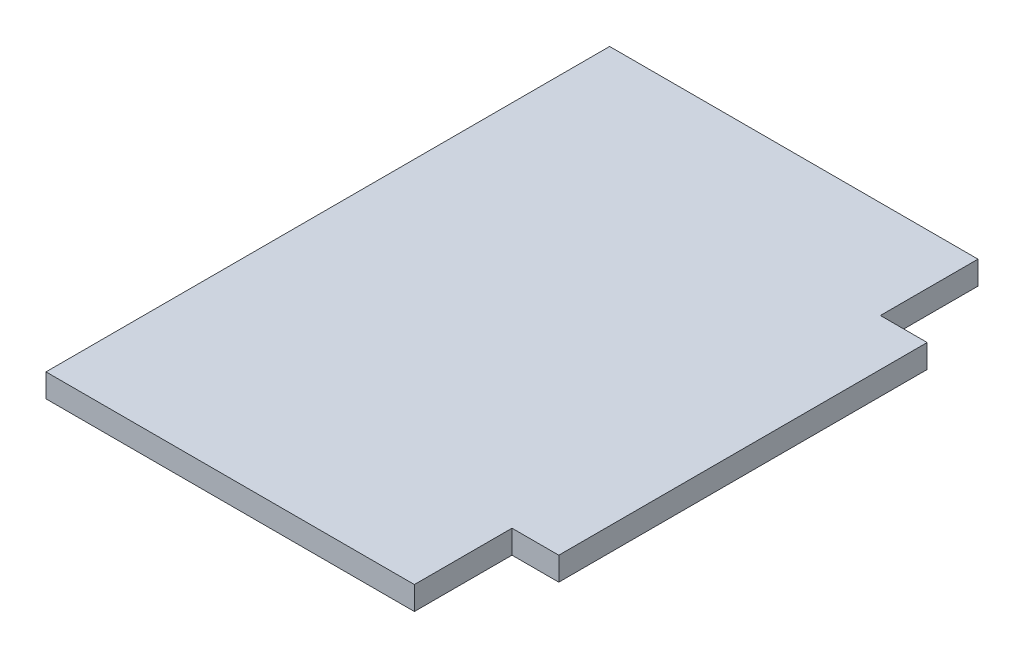
ISO-10303-21;
HEADER;
FILE_DESCRIPTION(('STEP AP214'),'2;1');
FILE_NAME('part.step','',(''),(''),'','','');
FILE_SCHEMA(('AUTOMOTIVE_DESIGN { 1 0 10303 214 1 1 1 1 }'));
ENDSEC;
DATA;
#1=APPLICATION_CONTEXT('core data for automotive mechanical design processes');
#2=APPLICATION_PROTOCOL_DEFINITION('international standard','automotive_design',2000,#1);
#3=PRODUCT_CONTEXT('',#1,'mechanical');
#4=PRODUCT('Part','Part','',(#3));
#5=PRODUCT_RELATED_PRODUCT_CATEGORY('part','',(#4));
#6=PRODUCT_DEFINITION_FORMATION('','',#4);
#7=PRODUCT_DEFINITION_CONTEXT('part definition',#1,'design');
#8=PRODUCT_DEFINITION('design','',#6,#7);
#9=PRODUCT_DEFINITION_SHAPE('','',#8);
#10=(LENGTH_UNIT() NAMED_UNIT(*) SI_UNIT(.MILLI.,.METRE.));
#11=(NAMED_UNIT(*) PLANE_ANGLE_UNIT() SI_UNIT($,.RADIAN.));
#12=(NAMED_UNIT(*) SI_UNIT($,.STERADIAN.) SOLID_ANGLE_UNIT());
#13=UNCERTAINTY_MEASURE_WITH_UNIT(LENGTH_MEASURE(1.E-05),#10,'distance_accuracy_value','');
#14=(GEOMETRIC_REPRESENTATION_CONTEXT(3) GLOBAL_UNCERTAINTY_ASSIGNED_CONTEXT((#13)) GLOBAL_UNIT_ASSIGNED_CONTEXT((#10,
#11,#12)) REPRESENTATION_CONTEXT('',''));
#15=CARTESIAN_POINT('',(0.,0.,0.));
#16=DIRECTION('',(0.,0.,1.));
#17=DIRECTION('',(1.,0.,0.));
#18=AXIS2_PLACEMENT_3D('',#15,#16,#17);
#19=CARTESIAN_POINT('',(-25.,3.175,0.));
#20=DIRECTION('',(-1.,0.,0.));
#21=DIRECTION('',(0.,0.,1.));
#22=AXIS2_PLACEMENT_3D('',#19,#20,#21);
#23=PLANE('',#22);
#24=DIRECTION('',(0.,0.,-1.));
#25=VECTOR('',#24,1.);
#26=CARTESIAN_POINT('',(-25.,0.,0.));
#27=LINE('',#26,#25);
#28=CARTESIAN_POINT('',(-25.,0.,63.25));
#29=VERTEX_POINT('',#28);
#30=CARTESIAN_POINT('',(-25.,0.,-13.25));
#31=VERTEX_POINT('',#30);
#32=EDGE_CURVE('E127',#29,#31,#27,.T.);
#33=ORIENTED_EDGE('',*,*,#32,.F.);
#34=DIRECTION('',(0.,-1.,0.));
#35=VECTOR('',#34,1.);
#36=CARTESIAN_POINT('',(-25.,3.175,63.25));
#37=LINE('',#36,#35);
#38=CARTESIAN_POINT('',(-25.,3.175,63.25));
#39=VERTEX_POINT('',#38);
#40=EDGE_CURVE('E11',#39,#29,#37,.T.);
#41=ORIENTED_EDGE('',*,*,#40,.F.);
#42=DIRECTION('',(0.,0.,-1.));
#43=VECTOR('',#42,1.);
#44=CARTESIAN_POINT('',(-25.,3.175,0.));
#45=LINE('',#44,#43);
#46=CARTESIAN_POINT('',(-25.,3.175,-13.25));
#47=VERTEX_POINT('',#46);
#48=EDGE_CURVE('E147',#39,#47,#45,.T.);
#49=ORIENTED_EDGE('',*,*,#48,.T.);
#50=DIRECTION('',(0.,-1.,0.));
#51=VECTOR('',#50,1.);
#52=CARTESIAN_POINT('',(-25.,3.175,-13.25));
#53=LINE('',#52,#51);
#54=EDGE_CURVE('E50',#47,#31,#53,.T.);
#55=ORIENTED_EDGE('',*,*,#54,.T.);
#56=EDGE_LOOP('',(#33,#41,#49,#55));
#57=FACE_BOUND('',#56,.T.);
#58=ADVANCED_FACE('F34',(#57),#23,.T.);
#59=CARTESIAN_POINT('',(0.,3.175,63.25));
#60=DIRECTION('',(0.,0.,1.));
#61=DIRECTION('',(1.,0.,0.));
#62=AXIS2_PLACEMENT_3D('',#59,#60,#61);
#63=PLANE('',#62);
#64=DIRECTION('',(-1.,0.,0.));
#65=VECTOR('',#64,1.);
#66=CARTESIAN_POINT('',(0.,0.,63.25));
#67=LINE('',#66,#65);
#68=CARTESIAN_POINT('',(25.,0.,63.25));
#69=VERTEX_POINT('',#68);
#70=EDGE_CURVE('E129',#69,#29,#67,.T.);
#71=ORIENTED_EDGE('',*,*,#70,.F.);
#72=DIRECTION('',(0.,-1.,0.));
#73=VECTOR('',#72,1.);
#74=CARTESIAN_POINT('',(25.,3.175,63.25));
#75=LINE('',#74,#73);
#76=CARTESIAN_POINT('',(25.,3.175,63.25));
#77=VERTEX_POINT('',#76);
#78=EDGE_CURVE('E42',#77,#69,#75,.T.);
#79=ORIENTED_EDGE('',*,*,#78,.F.);
#80=DIRECTION('',(-1.,0.,0.));
#81=VECTOR('',#80,1.);
#82=CARTESIAN_POINT('',(0.,3.175,63.25));
#83=LINE('',#82,#81);
#84=EDGE_CURVE('E173',#77,#39,#83,.T.);
#85=ORIENTED_EDGE('',*,*,#84,.T.);
#86=ORIENTED_EDGE('',*,*,#40,.T.);
#87=EDGE_LOOP('',(#71,#79,#85,#86));
#88=FACE_BOUND('',#87,.T.);
#89=ADVANCED_FACE('F164',(#88),#63,.T.);
#90=CARTESIAN_POINT('',(25.,3.175,0.));
#91=DIRECTION('',(1.,0.,0.));
#92=DIRECTION('',(0.,0.,-1.));
#93=AXIS2_PLACEMENT_3D('',#90,#91,#92);
#94=PLANE('',#93);
#95=DIRECTION('',(0.,0.,1.));
#96=VECTOR('',#95,1.);
#97=CARTESIAN_POINT('',(25.,0.,0.));
#98=LINE('',#97,#96);
#99=CARTESIAN_POINT('',(25.,0.,50.));
#100=VERTEX_POINT('',#99);
#101=EDGE_CURVE('E132',#100,#69,#98,.T.);
#102=ORIENTED_EDGE('',*,*,#101,.F.);
#103=DIRECTION('',(0.,-1.,0.));
#104=VECTOR('',#103,1.);
#105=CARTESIAN_POINT('',(25.,3.175,50.));
#106=LINE('',#105,#104);
#107=CARTESIAN_POINT('',(25.,3.175,50.));
#108=VERTEX_POINT('',#107);
#109=EDGE_CURVE('E153',#108,#100,#106,.T.);
#110=ORIENTED_EDGE('',*,*,#109,.F.);
#111=DIRECTION('',(0.,0.,1.));
#112=VECTOR('',#111,1.);
#113=CARTESIAN_POINT('',(25.,3.175,0.));
#114=LINE('',#113,#112);
#115=EDGE_CURVE('E160',#108,#77,#114,.T.);
#116=ORIENTED_EDGE('',*,*,#115,.T.);
#117=ORIENTED_EDGE('',*,*,#78,.T.);
#118=EDGE_LOOP('',(#102,#110,#116,#117));
#119=FACE_BOUND('',#118,.T.);
#120=ADVANCED_FACE('F158',(#119),#94,.T.);
#121=CARTESIAN_POINT('',(0.,3.175,50.));
#122=DIRECTION('',(0.,0.,1.));
#123=DIRECTION('',(1.,0.,0.));
#124=AXIS2_PLACEMENT_3D('',#121,#122,#123);
#125=PLANE('',#124);
#126=DIRECTION('',(-1.,0.,0.));
#127=VECTOR('',#126,1.);
#128=CARTESIAN_POINT('',(0.,0.,50.));
#129=LINE('',#128,#127);
#130=CARTESIAN_POINT('',(31.35,0.,50.));
#131=VERTEX_POINT('',#130);
#132=EDGE_CURVE('E135',#131,#100,#129,.T.);
#133=ORIENTED_EDGE('',*,*,#132,.F.);
#134=DIRECTION('',(0.,-1.,0.));
#135=VECTOR('',#134,1.);
#136=CARTESIAN_POINT('',(31.35,3.175,50.));
#137=LINE('',#136,#135);
#138=CARTESIAN_POINT('',(31.35,3.175,50.));
#139=VERTEX_POINT('',#138);
#140=EDGE_CURVE('E151',#139,#131,#137,.T.);
#141=ORIENTED_EDGE('',*,*,#140,.F.);
#142=DIRECTION('',(-1.,0.,0.));
#143=VECTOR('',#142,1.);
#144=CARTESIAN_POINT('',(0.,3.175,50.));
#145=LINE('',#144,#143);
#146=EDGE_CURVE('E172',#139,#108,#145,.T.);
#147=ORIENTED_EDGE('',*,*,#146,.T.);
#148=ORIENTED_EDGE('',*,*,#109,.T.);
#149=EDGE_LOOP('',(#133,#141,#147,#148));
#150=FACE_BOUND('',#149,.T.);
#151=ADVANCED_FACE('F170',(#150),#125,.T.);
#152=CARTESIAN_POINT('',(31.35,3.175,0.));
#153=DIRECTION('',(1.,0.,0.));
#154=DIRECTION('',(0.,0.,-1.));
#155=AXIS2_PLACEMENT_3D('',#152,#153,#154);
#156=PLANE('',#155);
#157=DIRECTION('',(0.,0.,1.));
#158=VECTOR('',#157,1.);
#159=CARTESIAN_POINT('',(31.35,0.,0.));
#160=LINE('',#159,#158);
#161=CARTESIAN_POINT('',(31.35,0.,0.));
#162=VERTEX_POINT('',#161);
#163=EDGE_CURVE('E138',#162,#131,#160,.T.);
#164=ORIENTED_EDGE('',*,*,#163,.F.);
#165=DIRECTION('',(0.,-1.,0.));
#166=VECTOR('',#165,1.);
#167=CARTESIAN_POINT('',(31.35,3.175,0.));
#168=LINE('',#167,#166);
#169=CARTESIAN_POINT('',(31.35,3.175,0.));
#170=VERTEX_POINT('',#169);
#171=EDGE_CURVE('E109',#170,#162,#168,.T.);
#172=ORIENTED_EDGE('',*,*,#171,.F.);
#173=DIRECTION('',(0.,0.,1.));
#174=VECTOR('',#173,1.);
#175=CARTESIAN_POINT('',(31.35,3.175,0.));
#176=LINE('',#175,#174);
#177=EDGE_CURVE('E119',#170,#139,#176,.T.);
#178=ORIENTED_EDGE('',*,*,#177,.T.);
#179=ORIENTED_EDGE('',*,*,#140,.T.);
#180=EDGE_LOOP('',(#164,#172,#178,#179));
#181=FACE_BOUND('',#180,.T.);
#182=ADVANCED_FACE('F179',(#181),#156,.T.);
#183=CARTESIAN_POINT('',(0.,3.175,0.));
#184=DIRECTION('',(0.,0.,-1.));
#185=DIRECTION('',(-1.,0.,0.));
#186=AXIS2_PLACEMENT_3D('',#183,#184,#185);
#187=PLANE('',#186);
#188=DIRECTION('',(1.,0.,0.));
#189=VECTOR('',#188,1.);
#190=CARTESIAN_POINT('',(0.,0.,0.));
#191=LINE('',#190,#189);
#192=CARTESIAN_POINT('',(25.,0.,0.));
#193=VERTEX_POINT('',#192);
#194=EDGE_CURVE('E105',#193,#162,#191,.T.);
#195=ORIENTED_EDGE('',*,*,#194,.F.);
#196=DIRECTION('',(0.,-1.,0.));
#197=VECTOR('',#196,1.);
#198=CARTESIAN_POINT('',(25.,3.175,0.));
#199=LINE('',#198,#197);
#200=CARTESIAN_POINT('',(25.,3.175,0.));
#201=VERTEX_POINT('',#200);
#202=EDGE_CURVE('E100',#201,#193,#199,.T.);
#203=ORIENTED_EDGE('',*,*,#202,.F.);
#204=DIRECTION('',(1.,0.,0.));
#205=VECTOR('',#204,1.);
#206=CARTESIAN_POINT('',(0.,3.175,0.));
#207=LINE('',#206,#205);
#208=EDGE_CURVE('E103',#201,#170,#207,.T.);
#209=ORIENTED_EDGE('',*,*,#208,.T.);
#210=ORIENTED_EDGE('',*,*,#171,.T.);
#211=EDGE_LOOP('',(#195,#203,#209,#210));
#212=FACE_BOUND('',#211,.T.);
#213=ADVANCED_FACE('F102',(#212),#187,.T.);
#214=CARTESIAN_POINT('',(25.,3.175,0.));
#215=DIRECTION('',(1.,0.,0.));
#216=DIRECTION('',(0.,0.,-1.));
#217=AXIS2_PLACEMENT_3D('',#214,#215,#216);
#218=PLANE('',#217);
#219=DIRECTION('',(0.,0.,1.));
#220=VECTOR('',#219,1.);
#221=CARTESIAN_POINT('',(25.,0.,0.));
#222=LINE('',#221,#220);
#223=CARTESIAN_POINT('',(25.,0.,-13.25));
#224=VERTEX_POINT('',#223);
#225=EDGE_CURVE('E142',#224,#193,#222,.T.);
#226=ORIENTED_EDGE('',*,*,#225,.F.);
#227=DIRECTION('',(0.,-1.,0.));
#228=VECTOR('',#227,1.);
#229=CARTESIAN_POINT('',(25.,3.175,-13.25));
#230=LINE('',#229,#228);
#231=CARTESIAN_POINT('',(25.,3.175,-13.25));
#232=VERTEX_POINT('',#231);
#233=EDGE_CURVE('E75',#232,#224,#230,.T.);
#234=ORIENTED_EDGE('',*,*,#233,.F.);
#235=DIRECTION('',(0.,0.,1.));
#236=VECTOR('',#235,1.);
#237=CARTESIAN_POINT('',(25.,3.175,0.));
#238=LINE('',#237,#236);
#239=EDGE_CURVE('E116',#232,#201,#238,.T.);
#240=ORIENTED_EDGE('',*,*,#239,.T.);
#241=ORIENTED_EDGE('',*,*,#202,.T.);
#242=EDGE_LOOP('',(#226,#234,#240,#241));
#243=FACE_BOUND('',#242,.T.);
#244=ADVANCED_FACE('F121',(#243),#218,.T.);
#245=CARTESIAN_POINT('',(0.,3.175,-13.25));
#246=DIRECTION('',(0.,0.,-1.));
#247=DIRECTION('',(-1.,0.,0.));
#248=AXIS2_PLACEMENT_3D('',#245,#246,#247);
#249=PLANE('',#248);
#250=DIRECTION('',(1.,0.,0.));
#251=VECTOR('',#250,1.);
#252=CARTESIAN_POINT('',(0.,0.,-13.25));
#253=LINE('',#252,#251);
#254=EDGE_CURVE('E144',#31,#224,#253,.T.);
#255=ORIENTED_EDGE('',*,*,#254,.F.);
#256=ORIENTED_EDGE('',*,*,#54,.F.);
#257=DIRECTION('',(1.,0.,0.));
#258=VECTOR('',#257,1.);
#259=CARTESIAN_POINT('',(0.,3.175,-13.25));
#260=LINE('',#259,#258);
#261=EDGE_CURVE('E122',#47,#232,#260,.T.);
#262=ORIENTED_EDGE('',*,*,#261,.T.);
#263=ORIENTED_EDGE('',*,*,#233,.T.);
#264=EDGE_LOOP('',(#255,#256,#262,#263));
#265=FACE_BOUND('',#264,.T.);
#266=ADVANCED_FACE('F180',(#265),#249,.T.);
#267=CARTESIAN_POINT('',(0.,3.175,0.));
#268=DIRECTION('',(0.,1.,0.));
#269=DIRECTION('',(0.,0.,1.));
#270=AXIS2_PLACEMENT_3D('',#267,#268,#269);
#271=PLANE('',#270);
#272=ORIENTED_EDGE('',*,*,#48,.F.);
#273=ORIENTED_EDGE('',*,*,#84,.F.);
#274=ORIENTED_EDGE('',*,*,#115,.F.);
#275=ORIENTED_EDGE('',*,*,#146,.F.);
#276=ORIENTED_EDGE('',*,*,#177,.F.);
#277=ORIENTED_EDGE('',*,*,#208,.F.);
#278=ORIENTED_EDGE('',*,*,#239,.F.);
#279=ORIENTED_EDGE('',*,*,#261,.F.);
#280=EDGE_LOOP('',(#272,#273,#274,#275,#276,#277,#278,#279));
#281=FACE_BOUND('',#280,.T.);
#282=ADVANCED_FACE('F114',(#281),#271,.T.);
#283=CARTESIAN_POINT('',(0.,0.,0.));
#284=DIRECTION('',(0.,1.,0.));
#285=DIRECTION('',(0.,0.,1.));
#286=AXIS2_PLACEMENT_3D('',#283,#284,#285);
#287=PLANE('',#286);
#288=ORIENTED_EDGE('',*,*,#32,.T.);
#289=ORIENTED_EDGE('',*,*,#254,.T.);
#290=ORIENTED_EDGE('',*,*,#225,.T.);
#291=ORIENTED_EDGE('',*,*,#194,.T.);
#292=ORIENTED_EDGE('',*,*,#163,.T.);
#293=ORIENTED_EDGE('',*,*,#132,.T.);
#294=ORIENTED_EDGE('',*,*,#101,.T.);
#295=ORIENTED_EDGE('',*,*,#70,.T.);
#296=EDGE_LOOP('',(#288,#289,#290,#291,#292,#293,#294,#295));
#297=FACE_BOUND('',#296,.T.);
#298=ADVANCED_FACE('F166',(#297),#287,.F.);
#299=CLOSED_SHELL('',(#58,#89,#120,#151,#182,#213,#244,#266,#282,#298));
#300=MANIFOLD_SOLID_BREP('B2',#299);
#301=ADVANCED_BREP_SHAPE_REPRESENTATION('',(#18,#300),#14);
#302=SHAPE_DEFINITION_REPRESENTATION(#9,#301);
ENDSEC;
END-ISO-10303-21;
